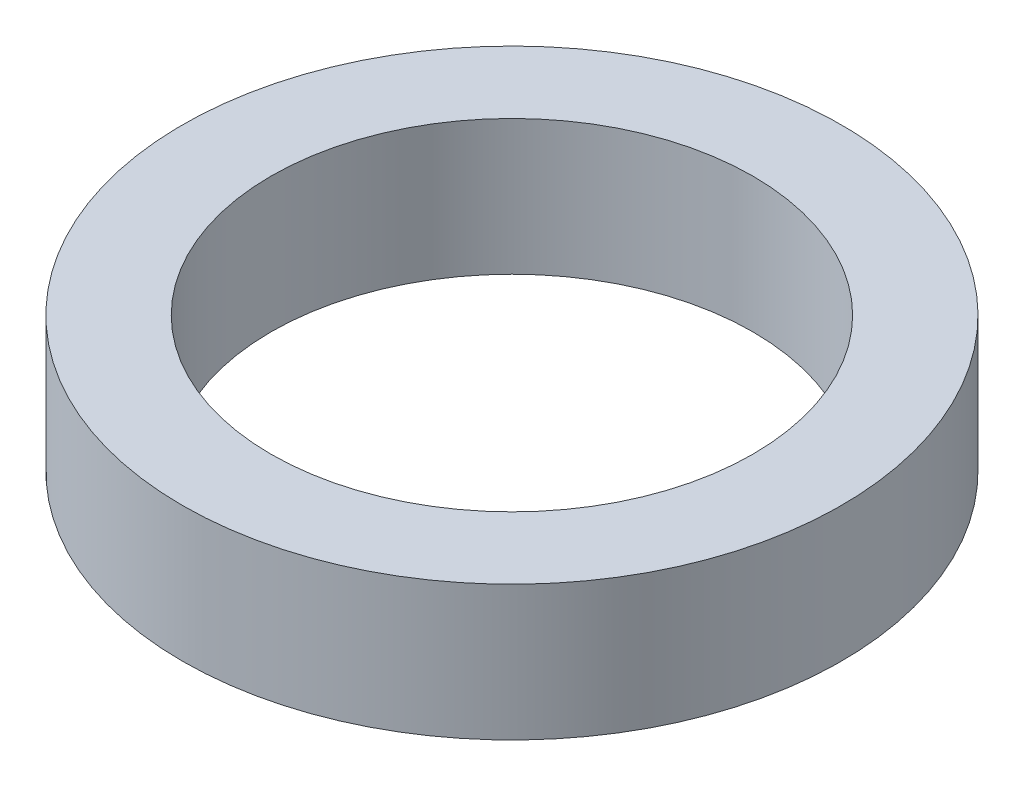
ISO-10303-21;
HEADER;
FILE_DESCRIPTION(('STEP AP214'),'2;1');
FILE_NAME('part.step','',(''),(''),'','','');
FILE_SCHEMA(('AUTOMOTIVE_DESIGN { 1 0 10303 214 1 1 1 1 }'));
ENDSEC;
DATA;
#1=APPLICATION_CONTEXT('core data for automotive mechanical design processes');
#2=APPLICATION_PROTOCOL_DEFINITION('international standard','automotive_design',2000,#1);
#3=PRODUCT_CONTEXT('',#1,'mechanical');
#4=PRODUCT('Part','Part','',(#3));
#5=PRODUCT_RELATED_PRODUCT_CATEGORY('part','',(#4));
#6=PRODUCT_DEFINITION_FORMATION('','',#4);
#7=PRODUCT_DEFINITION_CONTEXT('part definition',#1,'design');
#8=PRODUCT_DEFINITION('design','',#6,#7);
#9=PRODUCT_DEFINITION_SHAPE('','',#8);
#10=(LENGTH_UNIT() NAMED_UNIT(*) SI_UNIT(.MILLI.,.METRE.));
#11=(NAMED_UNIT(*) PLANE_ANGLE_UNIT() SI_UNIT($,.RADIAN.));
#12=(NAMED_UNIT(*) SI_UNIT($,.STERADIAN.) SOLID_ANGLE_UNIT());
#13=UNCERTAINTY_MEASURE_WITH_UNIT(LENGTH_MEASURE(1.E-05),#10,'distance_accuracy_value','');
#14=(GEOMETRIC_REPRESENTATION_CONTEXT(3) GLOBAL_UNCERTAINTY_ASSIGNED_CONTEXT((#13)) GLOBAL_UNIT_ASSIGNED_CONTEXT((#10,
#11,#12)) REPRESENTATION_CONTEXT('',''));
#15=CARTESIAN_POINT('',(0.,0.,0.));
#16=DIRECTION('',(0.,0.,1.));
#17=DIRECTION('',(1.,0.,0.));
#18=AXIS2_PLACEMENT_3D('',#15,#16,#17);
#19=CARTESIAN_POINT('',(0.,7.,0.));
#20=DIRECTION('',(0.,1.,0.));
#21=DIRECTION('',(0.,0.,1.));
#22=AXIS2_PLACEMENT_3D('',#19,#20,#21);
#23=PLANE('',#22);
#24=CARTESIAN_POINT('',(0.,7.,0.));
#25=DIRECTION('',(0.,1.,0.));
#26=DIRECTION('',(0.,0.,1.));
#27=AXIS2_PLACEMENT_3D('',#24,#25,#26);
#28=CIRCLE('',#27,17.1);
#29=CARTESIAN_POINT('',(0.,7.,17.1));
#30=VERTEX_POINT('',#29);
#31=EDGE_CURVE('E11',#30,#30,#28,.T.);
#32=ORIENTED_EDGE('',*,*,#31,.T.);
#33=EDGE_LOOP('',(#32));
#34=FACE_BOUND('',#33,.T.);
#35=CARTESIAN_POINT('',(0.,7.,0.));
#36=DIRECTION('',(0.,1.,0.));
#37=DIRECTION('',(0.,0.,1.));
#38=AXIS2_PLACEMENT_3D('',#35,#36,#37);
#39=CIRCLE('',#38,12.5);
#40=CARTESIAN_POINT('',(0.,7.,12.5));
#41=VERTEX_POINT('',#40);
#42=EDGE_CURVE('E59',#41,#41,#39,.T.);
#43=ORIENTED_EDGE('',*,*,#42,.F.);
#44=EDGE_LOOP('',(#43));
#45=FACE_BOUND('',#44,.T.);
#46=ADVANCED_FACE('F46',(#34,#45),#23,.T.);
#47=CARTESIAN_POINT('',(0.,0.,0.));
#48=DIRECTION('',(0.,1.,0.));
#49=DIRECTION('',(0.,0.,1.));
#50=AXIS2_PLACEMENT_3D('',#47,#48,#49);
#51=PLANE('',#50);
#52=CARTESIAN_POINT('',(0.,0.,0.));
#53=DIRECTION('',(0.,1.,0.));
#54=DIRECTION('',(0.,0.,1.));
#55=AXIS2_PLACEMENT_3D('',#52,#53,#54);
#56=CIRCLE('',#55,17.1);
#57=CARTESIAN_POINT('',(0.,0.,17.1));
#58=VERTEX_POINT('',#57);
#59=EDGE_CURVE('E50',#58,#58,#56,.T.);
#60=ORIENTED_EDGE('',*,*,#59,.F.);
#61=EDGE_LOOP('',(#60));
#62=FACE_BOUND('',#61,.T.);
#63=CARTESIAN_POINT('',(0.,0.,0.));
#64=DIRECTION('',(0.,1.,0.));
#65=DIRECTION('',(0.,0.,1.));
#66=AXIS2_PLACEMENT_3D('',#63,#64,#65);
#67=CIRCLE('',#66,12.5);
#68=CARTESIAN_POINT('',(0.,0.,12.5));
#69=VERTEX_POINT('',#68);
#70=EDGE_CURVE('E61',#69,#69,#67,.T.);
#71=ORIENTED_EDGE('',*,*,#70,.T.);
#72=EDGE_LOOP('',(#71));
#73=FACE_BOUND('',#72,.T.);
#74=ADVANCED_FACE('F73',(#62,#73),#51,.F.);
#75=CARTESIAN_POINT('',(0.,7.,0.));
#76=DIRECTION('',(0.,-1.,0.));
#77=DIRECTION('',(0.,0.,-1.));
#78=AXIS2_PLACEMENT_3D('',#75,#76,#77);
#79=CYLINDRICAL_SURFACE('',#78,17.1);
#80=ORIENTED_EDGE('',*,*,#31,.F.);
#81=EDGE_LOOP('',(#80));
#82=FACE_BOUND('',#81,.T.);
#83=ORIENTED_EDGE('',*,*,#59,.T.);
#84=EDGE_LOOP('',(#83));
#85=FACE_BOUND('',#84,.T.);
#86=ADVANCED_FACE('F48',(#82,#85),#79,.T.);
#87=CARTESIAN_POINT('',(0.,7.,0.));
#88=DIRECTION('',(0.,-1.,0.));
#89=DIRECTION('',(0.,0.,-1.));
#90=AXIS2_PLACEMENT_3D('',#87,#88,#89);
#91=CYLINDRICAL_SURFACE('',#90,12.5);
#92=ORIENTED_EDGE('',*,*,#42,.T.);
#93=EDGE_LOOP('',(#92));
#94=FACE_BOUND('',#93,.T.);
#95=ORIENTED_EDGE('',*,*,#70,.F.);
#96=EDGE_LOOP('',(#95));
#97=FACE_BOUND('',#96,.T.);
#98=ADVANCED_FACE('F69',(#94,#97),#91,.F.);
#99=CLOSED_SHELL('',(#46,#74,#86,#98));
#100=MANIFOLD_SOLID_BREP('B2',#99);
#101=ADVANCED_BREP_SHAPE_REPRESENTATION('',(#18,#100),#14);
#102=SHAPE_DEFINITION_REPRESENTATION(#9,#101);
ENDSEC;
END-ISO-10303-21;
